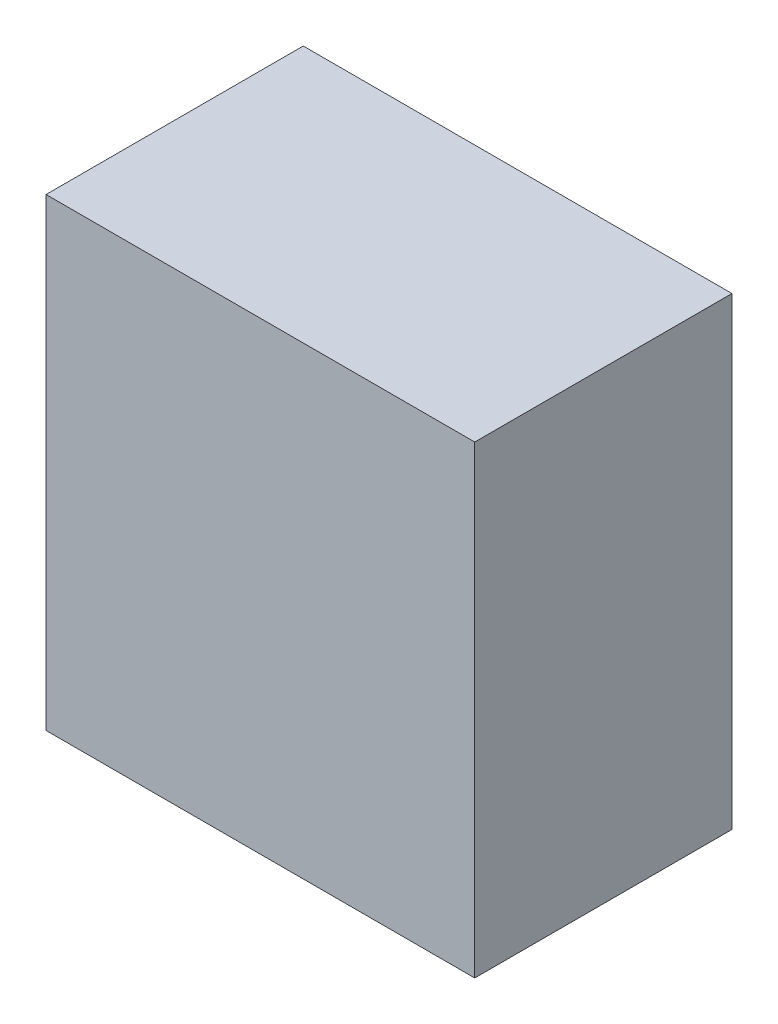
ISO-10303-21;
HEADER;
FILE_DESCRIPTION(('STEP AP214'),'2;1');
FILE_NAME('part.step','',(''),(''),'','','');
FILE_SCHEMA(('AUTOMOTIVE_DESIGN { 1 0 10303 214 1 1 1 1 }'));
ENDSEC;
DATA;
#1=APPLICATION_CONTEXT('core data for automotive mechanical design processes');
#2=APPLICATION_PROTOCOL_DEFINITION('international standard','automotive_design',2000,#1);
#3=PRODUCT_CONTEXT('',#1,'mechanical');
#4=PRODUCT('Part','Part','',(#3));
#5=PRODUCT_RELATED_PRODUCT_CATEGORY('part','',(#4));
#6=PRODUCT_DEFINITION_FORMATION('','',#4);
#7=PRODUCT_DEFINITION_CONTEXT('part definition',#1,'design');
#8=PRODUCT_DEFINITION('design','',#6,#7);
#9=PRODUCT_DEFINITION_SHAPE('','',#8);
#10=(LENGTH_UNIT() NAMED_UNIT(*) SI_UNIT(.MILLI.,.METRE.));
#11=(NAMED_UNIT(*) PLANE_ANGLE_UNIT() SI_UNIT($,.RADIAN.));
#12=(NAMED_UNIT(*) SI_UNIT($,.STERADIAN.) SOLID_ANGLE_UNIT());
#13=UNCERTAINTY_MEASURE_WITH_UNIT(LENGTH_MEASURE(1.E-05),#10,'distance_accuracy_value','');
#14=(GEOMETRIC_REPRESENTATION_CONTEXT(3) GLOBAL_UNCERTAINTY_ASSIGNED_CONTEXT((#13)) GLOBAL_UNIT_ASSIGNED_CONTEXT((#10,
#11,#12)) REPRESENTATION_CONTEXT('',''));
#15=CARTESIAN_POINT('',(0.,0.,0.));
#16=DIRECTION('',(0.,0.,1.));
#17=DIRECTION('',(1.,0.,0.));
#18=AXIS2_PLACEMENT_3D('',#15,#16,#17);
#19=CARTESIAN_POINT('',(305.,-55.73,87.));
#20=DIRECTION('',(-1.,0.,0.));
#21=DIRECTION('',(0.,0.,1.));
#22=AXIS2_PLACEMENT_3D('',#19,#20,#21);
#23=PLANE('',#22);
#24=DIRECTION('',(0.,1.,0.));
#25=VECTOR('',#24,1.);
#26=CARTESIAN_POINT('',(305.,-55.73,0.));
#27=LINE('',#26,#25);
#28=CARTESIAN_POINT('',(305.,-55.73,0.));
#29=VERTEX_POINT('',#28);
#30=CARTESIAN_POINT('',(305.,101.27,0.));
#31=VERTEX_POINT('',#30);
#32=EDGE_CURVE('E96',#29,#31,#27,.T.);
#33=ORIENTED_EDGE('',*,*,#32,.T.);
#34=DIRECTION('',(0.,0.,-1.));
#35=VECTOR('',#34,1.);
#36=CARTESIAN_POINT('',(305.,101.27,87.));
#37=LINE('',#36,#35);
#38=CARTESIAN_POINT('',(305.,101.27,87.));
#39=VERTEX_POINT('',#38);
#40=EDGE_CURVE('E11',#39,#31,#37,.T.);
#41=ORIENTED_EDGE('',*,*,#40,.F.);
#42=DIRECTION('',(0.,1.,0.));
#43=VECTOR('',#42,1.);
#44=CARTESIAN_POINT('',(305.,-55.73,87.));
#45=LINE('',#44,#43);
#46=CARTESIAN_POINT('',(305.,-55.73,87.));
#47=VERTEX_POINT('',#46);
#48=EDGE_CURVE('E84',#47,#39,#45,.T.);
#49=ORIENTED_EDGE('',*,*,#48,.F.);
#50=DIRECTION('',(0.,0.,-1.));
#51=VECTOR('',#50,1.);
#52=CARTESIAN_POINT('',(305.,-55.73,87.));
#53=LINE('',#52,#51);
#54=EDGE_CURVE('E92',#47,#29,#53,.T.);
#55=ORIENTED_EDGE('',*,*,#54,.T.);
#56=EDGE_LOOP('',(#33,#41,#49,#55));
#57=FACE_BOUND('',#56,.T.);
#58=ADVANCED_FACE('F33',(#57),#23,.F.);
#59=CARTESIAN_POINT('',(305.,101.27,87.));
#60=DIRECTION('',(0.,-1.,0.));
#61=DIRECTION('',(1.,0.,0.));
#62=AXIS2_PLACEMENT_3D('',#59,#60,#61);
#63=PLANE('',#62);
#64=DIRECTION('',(-1.,0.,0.));
#65=VECTOR('',#64,1.);
#66=CARTESIAN_POINT('',(305.,101.27,0.));
#67=LINE('',#66,#65);
#68=CARTESIAN_POINT('',(160.,101.27,0.));
#69=VERTEX_POINT('',#68);
#70=EDGE_CURVE('E88',#31,#69,#67,.T.);
#71=ORIENTED_EDGE('',*,*,#70,.T.);
#72=DIRECTION('',(0.,0.,-1.));
#73=VECTOR('',#72,1.);
#74=CARTESIAN_POINT('',(160.,101.27,87.));
#75=LINE('',#74,#73);
#76=CARTESIAN_POINT('',(160.,101.27,87.));
#77=VERTEX_POINT('',#76);
#78=EDGE_CURVE('E41',#77,#69,#75,.T.);
#79=ORIENTED_EDGE('',*,*,#78,.F.);
#80=DIRECTION('',(-1.,0.,0.));
#81=VECTOR('',#80,1.);
#82=CARTESIAN_POINT('',(305.,101.27,87.));
#83=LINE('',#82,#81);
#84=EDGE_CURVE('E79',#39,#77,#83,.T.);
#85=ORIENTED_EDGE('',*,*,#84,.F.);
#86=ORIENTED_EDGE('',*,*,#40,.T.);
#87=EDGE_LOOP('',(#71,#79,#85,#86));
#88=FACE_BOUND('',#87,.T.);
#89=ADVANCED_FACE('F87',(#88),#63,.F.);
#90=CARTESIAN_POINT('',(160.,-55.73,87.));
#91=DIRECTION('',(1.,0.,0.));
#92=DIRECTION('',(0.,0.,-1.));
#93=AXIS2_PLACEMENT_3D('',#90,#91,#92);
#94=PLANE('',#93);
#95=DIRECTION('',(0.,-1.,0.));
#96=VECTOR('',#95,1.);
#97=CARTESIAN_POINT('',(160.,-55.73,0.));
#98=LINE('',#97,#96);
#99=CARTESIAN_POINT('',(160.,-55.73,0.));
#100=VERTEX_POINT('',#99);
#101=EDGE_CURVE('E66',#69,#100,#98,.T.);
#102=ORIENTED_EDGE('',*,*,#101,.T.);
#103=DIRECTION('',(0.,0.,-1.));
#104=VECTOR('',#103,1.);
#105=CARTESIAN_POINT('',(160.,-55.73,87.));
#106=LINE('',#105,#104);
#107=CARTESIAN_POINT('',(160.,-55.73,87.));
#108=VERTEX_POINT('',#107);
#109=EDGE_CURVE('E89',#108,#100,#106,.T.);
#110=ORIENTED_EDGE('',*,*,#109,.F.);
#111=DIRECTION('',(0.,-1.,0.));
#112=VECTOR('',#111,1.);
#113=CARTESIAN_POINT('',(160.,-55.73,87.));
#114=LINE('',#113,#112);
#115=EDGE_CURVE('E82',#77,#108,#114,.T.);
#116=ORIENTED_EDGE('',*,*,#115,.F.);
#117=ORIENTED_EDGE('',*,*,#78,.T.);
#118=EDGE_LOOP('',(#102,#110,#116,#117));
#119=FACE_BOUND('',#118,.T.);
#120=ADVANCED_FACE('F90',(#119),#94,.F.);
#121=CARTESIAN_POINT('',(305.,-55.73,87.));
#122=DIRECTION('',(0.,1.,0.));
#123=DIRECTION('',(0.,0.,1.));
#124=AXIS2_PLACEMENT_3D('',#121,#122,#123);
#125=PLANE('',#124);
#126=DIRECTION('',(1.,0.,0.));
#127=VECTOR('',#126,1.);
#128=CARTESIAN_POINT('',(305.,-55.73,0.));
#129=LINE('',#128,#127);
#130=EDGE_CURVE('E72',#100,#29,#129,.T.);
#131=ORIENTED_EDGE('',*,*,#130,.T.);
#132=ORIENTED_EDGE('',*,*,#54,.F.);
#133=DIRECTION('',(1.,0.,0.));
#134=VECTOR('',#133,1.);
#135=CARTESIAN_POINT('',(305.,-55.73,87.));
#136=LINE('',#135,#134);
#137=EDGE_CURVE('E49',#108,#47,#136,.T.);
#138=ORIENTED_EDGE('',*,*,#137,.F.);
#139=ORIENTED_EDGE('',*,*,#109,.T.);
#140=EDGE_LOOP('',(#131,#132,#138,#139));
#141=FACE_BOUND('',#140,.T.);
#142=ADVANCED_FACE('F103',(#141),#125,.F.);
#143=CARTESIAN_POINT('',(305.,101.27,87.));
#144=DIRECTION('',(0.,0.,1.));
#145=DIRECTION('',(1.,0.,0.));
#146=AXIS2_PLACEMENT_3D('',#143,#144,#145);
#147=PLANE('',#146);
#148=ORIENTED_EDGE('',*,*,#48,.T.);
#149=ORIENTED_EDGE('',*,*,#84,.T.);
#150=ORIENTED_EDGE('',*,*,#115,.T.);
#151=ORIENTED_EDGE('',*,*,#137,.T.);
#152=EDGE_LOOP('',(#148,#149,#150,#151));
#153=FACE_BOUND('',#152,.T.);
#154=ADVANCED_FACE('F80',(#153),#147,.T.);
#155=CARTESIAN_POINT('',(305.,101.27,0.));
#156=DIRECTION('',(0.,0.,1.));
#157=DIRECTION('',(1.,0.,0.));
#158=AXIS2_PLACEMENT_3D('',#155,#156,#157);
#159=PLANE('',#158);
#160=ORIENTED_EDGE('',*,*,#32,.F.);
#161=ORIENTED_EDGE('',*,*,#130,.F.);
#162=ORIENTED_EDGE('',*,*,#101,.F.);
#163=ORIENTED_EDGE('',*,*,#70,.F.);
#164=EDGE_LOOP('',(#160,#161,#162,#163));
#165=FACE_BOUND('',#164,.T.);
#166=ADVANCED_FACE('F106',(#165),#159,.F.);
#167=CLOSED_SHELL('',(#58,#89,#120,#142,#154,#166));
#168=MANIFOLD_SOLID_BREP('B2',#167);
#169=ADVANCED_BREP_SHAPE_REPRESENTATION('',(#18,#168),#14);
#170=SHAPE_DEFINITION_REPRESENTATION(#9,#169);
ENDSEC;
END-ISO-10303-21;
